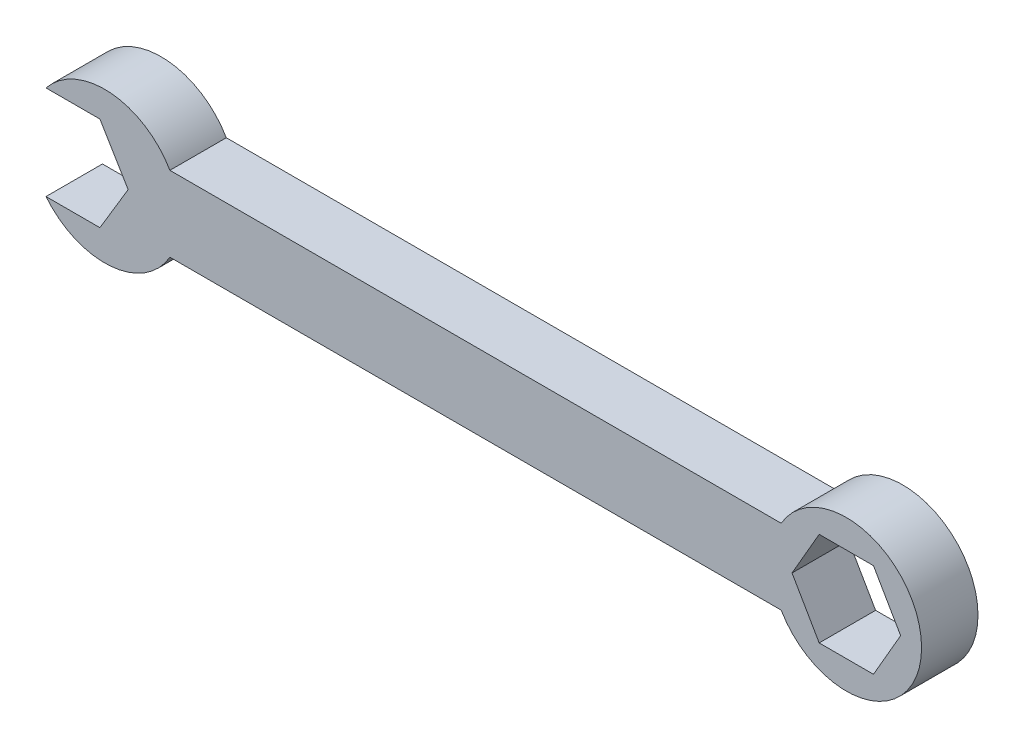
ISO-10303-21;
HEADER;
FILE_DESCRIPTION(('STEP AP214'),'2;1');
FILE_NAME('part.step','',(''),(''),'','','');
FILE_SCHEMA(('AUTOMOTIVE_DESIGN { 1 0 10303 214 1 1 1 1 }'));
ENDSEC;
DATA;
#1=APPLICATION_CONTEXT('core data for automotive mechanical design processes');
#2=APPLICATION_PROTOCOL_DEFINITION('international standard','automotive_design',2000,#1);
#3=PRODUCT_CONTEXT('',#1,'mechanical');
#4=PRODUCT('Part','Part','',(#3));
#5=PRODUCT_RELATED_PRODUCT_CATEGORY('part','',(#4));
#6=PRODUCT_DEFINITION_FORMATION('','',#4);
#7=PRODUCT_DEFINITION_CONTEXT('part definition',#1,'design');
#8=PRODUCT_DEFINITION('design','',#6,#7);
#9=PRODUCT_DEFINITION_SHAPE('','',#8);
#10=(LENGTH_UNIT() NAMED_UNIT(*) SI_UNIT(.MILLI.,.METRE.));
#11=(NAMED_UNIT(*) PLANE_ANGLE_UNIT() SI_UNIT($,.RADIAN.));
#12=(NAMED_UNIT(*) SI_UNIT($,.STERADIAN.) SOLID_ANGLE_UNIT());
#13=UNCERTAINTY_MEASURE_WITH_UNIT(LENGTH_MEASURE(1.E-05),#10,'distance_accuracy_value','');
#14=(GEOMETRIC_REPRESENTATION_CONTEXT(3) GLOBAL_UNCERTAINTY_ASSIGNED_CONTEXT((#13)) GLOBAL_UNIT_ASSIGNED_CONTEXT((#10,
#11,#12)) REPRESENTATION_CONTEXT('',''));
#15=CARTESIAN_POINT('',(0.,0.,0.));
#16=DIRECTION('',(0.,0.,1.));
#17=DIRECTION('',(1.,0.,0.));
#18=AXIS2_PLACEMENT_3D('',#15,#16,#17);
#19=CARTESIAN_POINT('',(0.,5.08,7.62));
#20=DIRECTION('',(0.,1.,0.));
#21=DIRECTION('',(0.,0.,1.));
#22=AXIS2_PLACEMENT_3D('',#19,#20,#21);
#23=PLANE('',#22);
#24=DIRECTION('',(1.,0.,0.));
#25=VECTOR('',#24,1.);
#26=CARTESIAN_POINT('',(0.,5.08,0.));
#27=LINE('',#26,#25);
#28=CARTESIAN_POINT('',(-41.275,5.08,0.));
#29=VERTEX_POINT('',#28);
#30=CARTESIAN_POINT('',(41.275,5.08,0.));
#31=VERTEX_POINT('',#30);
#32=EDGE_CURVE('E257',#29,#31,#27,.T.);
#33=ORIENTED_EDGE('',*,*,#32,.F.);
#34=DIRECTION('',(0.,0.,-1.));
#35=VECTOR('',#34,1.);
#36=CARTESIAN_POINT('',(-41.275,5.08,7.62));
#37=LINE('',#36,#35);
#38=CARTESIAN_POINT('',(-41.275,5.08,7.62));
#39=VERTEX_POINT('',#38);
#40=EDGE_CURVE('E11',#39,#29,#37,.T.);
#41=ORIENTED_EDGE('',*,*,#40,.F.);
#42=DIRECTION('',(1.,0.,0.));
#43=VECTOR('',#42,1.);
#44=CARTESIAN_POINT('',(0.,5.08,7.62));
#45=LINE('',#44,#43);
#46=CARTESIAN_POINT('',(41.275,5.08,7.62));
#47=VERTEX_POINT('',#46);
#48=EDGE_CURVE('E303',#39,#47,#45,.T.);
#49=ORIENTED_EDGE('',*,*,#48,.T.);
#50=DIRECTION('',(0.,0.,-1.));
#51=VECTOR('',#50,1.);
#52=CARTESIAN_POINT('',(41.275,5.08,7.62));
#53=LINE('',#52,#51);
#54=EDGE_CURVE('E118',#47,#31,#53,.T.);
#55=ORIENTED_EDGE('',*,*,#54,.T.);
#56=EDGE_LOOP('',(#33,#41,#49,#55));
#57=FACE_BOUND('',#56,.T.);
#58=ADVANCED_FACE('F43',(#57),#23,.T.);
#59=CARTESIAN_POINT('',(-50.0738181024499,0.,7.62));
#60=DIRECTION('',(0.,0.,-1.));
#61=DIRECTION('',(-1.,0.,0.));
#62=AXIS2_PLACEMENT_3D('',#59,#60,#61);
#63=CYLINDRICAL_SURFACE('',#62,10.16);
#64=CARTESIAN_POINT('',(-50.0738181024499,0.,0.));
#65=DIRECTION('',(0.,0.,1.));
#66=DIRECTION('',(1.,0.,0.));
#67=AXIS2_PLACEMENT_3D('',#64,#65,#66);
#68=CIRCLE('',#67,10.16);
#69=CARTESIAN_POINT('',(-58.0049655604159,6.34999999999999,0.));
#70=VERTEX_POINT('',#69);
#71=EDGE_CURVE('E253',#29,#70,#68,.T.);
#72=ORIENTED_EDGE('',*,*,#71,.T.);
#73=DIRECTION('',(0.,0.,-1.));
#74=VECTOR('',#73,1.);
#75=CARTESIAN_POINT('',(-58.0049655604159,6.34999999999999,7.62));
#76=LINE('',#75,#74);
#77=CARTESIAN_POINT('',(-58.0049655604159,6.34999999999999,7.62));
#78=VERTEX_POINT('',#77);
#79=EDGE_CURVE('E54',#78,#70,#76,.T.);
#80=ORIENTED_EDGE('',*,*,#79,.F.);
#81=CARTESIAN_POINT('',(-50.0738181024499,0.,7.62));
#82=DIRECTION('',(0.,0.,1.));
#83=DIRECTION('',(1.,0.,0.));
#84=AXIS2_PLACEMENT_3D('',#81,#82,#83);
#85=CIRCLE('',#84,10.16);
#86=EDGE_CURVE('E299',#39,#78,#85,.T.);
#87=ORIENTED_EDGE('',*,*,#86,.F.);
#88=ORIENTED_EDGE('',*,*,#40,.T.);
#89=EDGE_LOOP('',(#72,#80,#87,#88));
#90=FACE_BOUND('',#89,.T.);
#91=ADVANCED_FACE('F354',(#90),#63,.T.);
#92=CARTESIAN_POINT('',(0.,6.34999999999998,7.62));
#93=DIRECTION('',(0.,1.,0.));
#94=DIRECTION('',(-1.,0.,0.));
#95=AXIS2_PLACEMENT_3D('',#92,#93,#94);
#96=PLANE('',#95);
#97=DIRECTION('',(1.,0.,0.));
#98=VECTOR('',#97,1.);
#99=CARTESIAN_POINT('',(0.,6.34999999999998,0.));
#100=LINE('',#99,#98);
#101=CARTESIAN_POINT('',(-50.7238827361563,6.34999999999999,0.));
#102=VERTEX_POINT('',#101);
#103=EDGE_CURVE('E249',#70,#102,#100,.T.);
#104=ORIENTED_EDGE('',*,*,#103,.T.);
#105=DIRECTION('',(0.,0.,-1.));
#106=VECTOR('',#105,1.);
#107=CARTESIAN_POINT('',(-50.7238827361563,6.34999999999999,7.62));
#108=LINE('',#107,#106);
#109=CARTESIAN_POINT('',(-50.7238827361563,6.34999999999999,7.62));
#110=VERTEX_POINT('',#109);
#111=EDGE_CURVE('E200',#110,#102,#108,.T.);
#112=ORIENTED_EDGE('',*,*,#111,.F.);
#113=DIRECTION('',(1.,0.,0.));
#114=VECTOR('',#113,1.);
#115=CARTESIAN_POINT('',(0.,6.34999999999998,7.62));
#116=LINE('',#115,#114);
#117=EDGE_CURVE('E295',#78,#110,#116,.T.);
#118=ORIENTED_EDGE('',*,*,#117,.F.);
#119=ORIENTED_EDGE('',*,*,#79,.T.);
#120=EDGE_LOOP('',(#104,#112,#118,#119));
#121=FACE_BOUND('',#120,.T.);
#122=ADVANCED_FACE('F359',(#121),#96,.F.);
#123=CARTESIAN_POINT('',(-34.4955020118796,-20.6973012071278,7.62));
#124=DIRECTION('',(0.857492925712544,0.514495755427527,0.));
#125=DIRECTION('',(-0.514495755427527,0.857492925712544,0.));
#126=AXIS2_PLACEMENT_3D('',#123,#124,#125);
#127=PLANE('',#126);
#128=DIRECTION('',(0.514495755427527,-0.857492925712544,0.));
#129=VECTOR('',#128,1.);
#130=CARTESIAN_POINT('',(-34.4955020118796,-20.6973012071278,0.));
#131=LINE('',#130,#129);
#132=CARTESIAN_POINT('',(-46.9138827361563,0.,0.));
#133=VERTEX_POINT('',#132);
#134=EDGE_CURVE('E245',#102,#133,#131,.T.);
#135=ORIENTED_EDGE('',*,*,#134,.T.);
#136=DIRECTION('',(0.,0.,-1.));
#137=VECTOR('',#136,1.);
#138=CARTESIAN_POINT('',(-46.9138827361563,0.,7.62));
#139=LINE('',#138,#137);
#140=CARTESIAN_POINT('',(-46.9138827361563,0.,7.62));
#141=VERTEX_POINT('',#140);
#142=EDGE_CURVE('E196',#141,#133,#139,.T.);
#143=ORIENTED_EDGE('',*,*,#142,.F.);
#144=DIRECTION('',(0.514495755427527,-0.857492925712544,0.));
#145=VECTOR('',#144,1.);
#146=CARTESIAN_POINT('',(-34.4955020118796,-20.6973012071278,7.62));
#147=LINE('',#146,#145);
#148=EDGE_CURVE('E291',#110,#141,#147,.T.);
#149=ORIENTED_EDGE('',*,*,#148,.F.);
#150=ORIENTED_EDGE('',*,*,#111,.T.);
#151=EDGE_LOOP('',(#135,#143,#149,#150));
#152=FACE_BOUND('',#151,.T.);
#153=ADVANCED_FACE('F365',(#152),#127,.F.);
#154=CARTESIAN_POINT('',(-34.4955020118797,20.6973012071278,7.62));
#155=DIRECTION('',(0.857492925712545,-0.514495755427526,0.));
#156=DIRECTION('',(0.514495755427526,0.857492925712545,0.));
#157=AXIS2_PLACEMENT_3D('',#154,#155,#156);
#158=PLANE('',#157);
#159=DIRECTION('',(-0.514495755427526,-0.857492925712545,0.));
#160=VECTOR('',#159,1.);
#161=CARTESIAN_POINT('',(-34.4955020118797,20.6973012071278,0.));
#162=LINE('',#161,#160);
#163=CARTESIAN_POINT('',(-50.7238827361563,-6.35000000000001,0.));
#164=VERTEX_POINT('',#163);
#165=EDGE_CURVE('E241',#133,#164,#162,.T.);
#166=ORIENTED_EDGE('',*,*,#165,.T.);
#167=DIRECTION('',(0.,0.,-1.));
#168=VECTOR('',#167,1.);
#169=CARTESIAN_POINT('',(-50.7238827361563,-6.35000000000001,7.62));
#170=LINE('',#169,#168);
#171=CARTESIAN_POINT('',(-50.7238827361563,-6.35000000000001,7.62));
#172=VERTEX_POINT('',#171);
#173=EDGE_CURVE('E189',#172,#164,#170,.T.);
#174=ORIENTED_EDGE('',*,*,#173,.F.);
#175=DIRECTION('',(-0.514495755427526,-0.857492925712545,0.));
#176=VECTOR('',#175,1.);
#177=CARTESIAN_POINT('',(-34.4955020118797,20.6973012071278,7.62));
#178=LINE('',#177,#176);
#179=EDGE_CURVE('E288',#141,#172,#178,.T.);
#180=ORIENTED_EDGE('',*,*,#179,.F.);
#181=ORIENTED_EDGE('',*,*,#142,.T.);
#182=EDGE_LOOP('',(#166,#174,#180,#181));
#183=FACE_BOUND('',#182,.T.);
#184=ADVANCED_FACE('F369',(#183),#158,.F.);
#185=CARTESIAN_POINT('',(0.,-6.35000000000003,7.62));
#186=DIRECTION('',(0.,1.,0.));
#187=DIRECTION('',(-1.,0.,0.));
#188=AXIS2_PLACEMENT_3D('',#185,#186,#187);
#189=PLANE('',#188);
#190=DIRECTION('',(1.,0.,0.));
#191=VECTOR('',#190,1.);
#192=CARTESIAN_POINT('',(0.,-6.35000000000003,0.));
#193=LINE('',#192,#191);
#194=CARTESIAN_POINT('',(-58.0049655604159,-6.35000000000001,0.));
#195=VERTEX_POINT('',#194);
#196=EDGE_CURVE('E237',#195,#164,#193,.T.);
#197=ORIENTED_EDGE('',*,*,#196,.F.);
#198=DIRECTION('',(0.,0.,-1.));
#199=VECTOR('',#198,1.);
#200=CARTESIAN_POINT('',(-58.0049655604159,-6.35000000000001,7.62));
#201=LINE('',#200,#199);
#202=CARTESIAN_POINT('',(-58.0049655604159,-6.35000000000001,7.62));
#203=VERTEX_POINT('',#202);
#204=EDGE_CURVE('E185',#203,#195,#201,.T.);
#205=ORIENTED_EDGE('',*,*,#204,.F.);
#206=DIRECTION('',(1.,0.,0.));
#207=VECTOR('',#206,1.);
#208=CARTESIAN_POINT('',(0.,-6.35000000000003,7.62));
#209=LINE('',#208,#207);
#210=EDGE_CURVE('E177',#203,#172,#209,.T.);
#211=ORIENTED_EDGE('',*,*,#210,.T.);
#212=ORIENTED_EDGE('',*,*,#173,.T.);
#213=EDGE_LOOP('',(#197,#205,#211,#212));
#214=FACE_BOUND('',#213,.T.);
#215=ADVANCED_FACE('F373',(#214),#189,.T.);
#216=CARTESIAN_POINT('',(-50.0738181024499,0.,7.62));
#217=DIRECTION('',(0.,0.,-1.));
#218=DIRECTION('',(-1.,0.,0.));
#219=AXIS2_PLACEMENT_3D('',#216,#217,#218);
#220=CYLINDRICAL_SURFACE('',#219,10.16);
#221=CARTESIAN_POINT('',(-50.0738181024499,0.,0.));
#222=DIRECTION('',(0.,0.,1.));
#223=DIRECTION('',(1.,0.,0.));
#224=AXIS2_PLACEMENT_3D('',#221,#222,#223);
#225=CIRCLE('',#224,10.16);
#226=CARTESIAN_POINT('',(-41.275,-5.08,0.));
#227=VERTEX_POINT('',#226);
#228=EDGE_CURVE('E183',#195,#227,#225,.T.);
#229=ORIENTED_EDGE('',*,*,#228,.T.);
#230=DIRECTION('',(0.,0.,-1.));
#231=VECTOR('',#230,1.);
#232=CARTESIAN_POINT('',(-41.275,-5.08,7.62));
#233=LINE('',#232,#231);
#234=CARTESIAN_POINT('',(-41.275,-5.08,7.62));
#235=VERTEX_POINT('',#234);
#236=EDGE_CURVE('E167',#235,#227,#233,.T.);
#237=ORIENTED_EDGE('',*,*,#236,.F.);
#238=CARTESIAN_POINT('',(-50.0738181024499,0.,7.62));
#239=DIRECTION('',(0.,0.,1.));
#240=DIRECTION('',(1.,0.,0.));
#241=AXIS2_PLACEMENT_3D('',#238,#239,#240);
#242=CIRCLE('',#241,10.16);
#243=EDGE_CURVE('E171',#203,#235,#242,.T.);
#244=ORIENTED_EDGE('',*,*,#243,.F.);
#245=ORIENTED_EDGE('',*,*,#204,.T.);
#246=EDGE_LOOP('',(#229,#237,#244,#245));
#247=FACE_BOUND('',#246,.T.);
#248=ADVANCED_FACE('F181',(#247),#220,.T.);
#249=CARTESIAN_POINT('',(0.,-5.08,7.62));
#250=DIRECTION('',(0.,1.,0.));
#251=DIRECTION('',(0.,0.,1.));
#252=AXIS2_PLACEMENT_3D('',#249,#250,#251);
#253=PLANE('',#252);
#254=DIRECTION('',(1.,0.,0.));
#255=VECTOR('',#254,1.);
#256=CARTESIAN_POINT('',(0.,-5.08,0.));
#257=LINE('',#256,#255);
#258=CARTESIAN_POINT('',(41.275,-5.08,0.));
#259=VERTEX_POINT('',#258);
#260=EDGE_CURVE('E232',#227,#259,#257,.T.);
#261=ORIENTED_EDGE('',*,*,#260,.T.);
#262=DIRECTION('',(0.,0.,-1.));
#263=VECTOR('',#262,1.);
#264=CARTESIAN_POINT('',(41.275,-5.08,7.62));
#265=LINE('',#264,#263);
#266=CARTESIAN_POINT('',(41.275,-5.08,7.62));
#267=VERTEX_POINT('',#266);
#268=EDGE_CURVE('E169',#267,#259,#265,.T.);
#269=ORIENTED_EDGE('',*,*,#268,.F.);
#270=DIRECTION('',(1.,0.,0.));
#271=VECTOR('',#270,1.);
#272=CARTESIAN_POINT('',(0.,-5.08,7.62));
#273=LINE('',#272,#271);
#274=EDGE_CURVE('E162',#235,#267,#273,.T.);
#275=ORIENTED_EDGE('',*,*,#274,.F.);
#276=ORIENTED_EDGE('',*,*,#236,.T.);
#277=EDGE_LOOP('',(#261,#269,#275,#276));
#278=FACE_BOUND('',#277,.T.);
#279=ADVANCED_FACE('F165',(#278),#253,.F.);
#280=CARTESIAN_POINT('',(43.0546248908686,-24.8575992706013,7.62));
#281=DIRECTION('',(-0.866025403784439,0.5,0.));
#282=DIRECTION('',(-0.5,-0.866025403784439,0.));
#283=AXIS2_PLACEMENT_3D('',#280,#281,#282);
#284=PLANE('',#283);
#285=DIRECTION('',(0.5,0.866025403784439,0.));
#286=VECTOR('',#285,1.);
#287=CARTESIAN_POINT('',(43.0546248908686,-24.8575992706013,0.));
#288=LINE('',#287,#286);
#289=CARTESIAN_POINT('',(53.739992311804,-6.35,0.));
#290=VERTEX_POINT('',#289);
#291=CARTESIAN_POINT('',(57.4061665211581,0.,0.));
#292=VERTEX_POINT('',#291);
#293=EDGE_CURVE('E280',#290,#292,#288,.T.);
#294=ORIENTED_EDGE('',*,*,#293,.F.);
#295=DIRECTION('',(0.,0.,-1.));
#296=VECTOR('',#295,1.);
#297=CARTESIAN_POINT('',(53.739992311804,-6.35,7.62));
#298=LINE('',#297,#296);
#299=CARTESIAN_POINT('',(53.739992311804,-6.35,7.62));
#300=VERTEX_POINT('',#299);
#301=EDGE_CURVE('E47',#300,#290,#298,.T.);
#302=ORIENTED_EDGE('',*,*,#301,.F.);
#303=DIRECTION('',(0.5,0.866025403784439,0.));
#304=VECTOR('',#303,1.);
#305=CARTESIAN_POINT('',(43.0546248908686,-24.8575992706013,7.62));
#306=LINE('',#305,#304);
#307=CARTESIAN_POINT('',(57.4061665211581,0.,7.62));
#308=VERTEX_POINT('',#307);
#309=EDGE_CURVE('E231',#300,#308,#306,.T.);
#310=ORIENTED_EDGE('',*,*,#309,.T.);
#311=DIRECTION('',(0.,0.,-1.));
#312=VECTOR('',#311,1.);
#313=CARTESIAN_POINT('',(57.4061665211581,0.,7.62));
#314=LINE('',#313,#312);
#315=EDGE_CURVE('E207',#308,#292,#314,.T.);
#316=ORIENTED_EDGE('',*,*,#315,.T.);
#317=EDGE_LOOP('',(#294,#302,#310,#316));
#318=FACE_BOUND('',#317,.T.);
#319=ADVANCED_FACE('F45',(#318),#284,.T.);
#320=CARTESIAN_POINT('',(0.,-6.34999999999998,7.62));
#321=DIRECTION('',(0.,1.,0.));
#322=DIRECTION('',(-1.,0.,0.));
#323=AXIS2_PLACEMENT_3D('',#320,#321,#322);
#324=PLANE('',#323);
#325=DIRECTION('',(1.,0.,0.));
#326=VECTOR('',#325,1.);
#327=CARTESIAN_POINT('',(0.,-6.34999999999998,0.));
#328=LINE('',#327,#326);
#329=CARTESIAN_POINT('',(46.4076438930958,-6.34999999999999,0.));
#330=VERTEX_POINT('',#329);
#331=EDGE_CURVE('E276',#330,#290,#328,.T.);
#332=ORIENTED_EDGE('',*,*,#331,.F.);
#333=DIRECTION('',(0.,0.,-1.));
#334=VECTOR('',#333,1.);
#335=CARTESIAN_POINT('',(46.4076438930958,-6.34999999999999,7.62));
#336=LINE('',#335,#334);
#337=CARTESIAN_POINT('',(46.4076438930958,-6.34999999999999,7.62));
#338=VERTEX_POINT('',#337);
#339=EDGE_CURVE('E218',#338,#330,#336,.T.);
#340=ORIENTED_EDGE('',*,*,#339,.F.);
#341=DIRECTION('',(1.,0.,0.));
#342=VECTOR('',#341,1.);
#343=CARTESIAN_POINT('',(0.,-6.34999999999998,7.62));
#344=LINE('',#343,#342);
#345=EDGE_CURVE('E321',#338,#300,#344,.T.);
#346=ORIENTED_EDGE('',*,*,#345,.T.);
#347=ORIENTED_EDGE('',*,*,#301,.T.);
#348=EDGE_LOOP('',(#332,#340,#346,#347));
#349=FACE_BOUND('',#348,.T.);
#350=ADVANCED_FACE('F336',(#349),#324,.T.);
#351=CARTESIAN_POINT('',(32.0561022628062,18.5075992706014,7.62));
#352=DIRECTION('',(0.866025403784439,0.5,0.));
#353=DIRECTION('',(-0.5,0.866025403784439,0.));
#354=AXIS2_PLACEMENT_3D('',#351,#352,#353);
#355=PLANE('',#354);
#356=DIRECTION('',(0.5,-0.866025403784439,0.));
#357=VECTOR('',#356,1.);
#358=CARTESIAN_POINT('',(32.0561022628062,18.5075992706014,0.));
#359=LINE('',#358,#357);
#360=CARTESIAN_POINT('',(42.7414696837416,0.,0.));
#361=VERTEX_POINT('',#360);
#362=EDGE_CURVE('E272',#361,#330,#359,.T.);
#363=ORIENTED_EDGE('',*,*,#362,.F.);
#364=DIRECTION('',(0.,0.,-1.));
#365=VECTOR('',#364,1.);
#366=CARTESIAN_POINT('',(42.7414696837416,0.,7.62));
#367=LINE('',#366,#365);
#368=CARTESIAN_POINT('',(42.7414696837416,0.,7.62));
#369=VERTEX_POINT('',#368);
#370=EDGE_CURVE('E216',#369,#361,#367,.T.);
#371=ORIENTED_EDGE('',*,*,#370,.F.);
#372=DIRECTION('',(0.5,-0.866025403784439,0.));
#373=VECTOR('',#372,1.);
#374=CARTESIAN_POINT('',(32.0561022628062,18.5075992706014,7.62));
#375=LINE('',#374,#373);
#376=EDGE_CURVE('E318',#369,#338,#375,.T.);
#377=ORIENTED_EDGE('',*,*,#376,.T.);
#378=ORIENTED_EDGE('',*,*,#339,.T.);
#379=EDGE_LOOP('',(#363,#371,#377,#378));
#380=FACE_BOUND('',#379,.T.);
#381=ADVANCED_FACE('F338',(#380),#355,.T.);
#382=CARTESIAN_POINT('',(32.0561022628062,-18.5075992706014,7.62));
#383=DIRECTION('',(0.866025403784439,-0.5,0.));
#384=DIRECTION('',(0.5,0.866025403784439,0.));
#385=AXIS2_PLACEMENT_3D('',#382,#383,#384);
#386=PLANE('',#385);
#387=DIRECTION('',(-0.5,-0.866025403784439,0.));
#388=VECTOR('',#387,1.);
#389=CARTESIAN_POINT('',(32.0561022628062,-18.5075992706014,0.));
#390=LINE('',#389,#388);
#391=CARTESIAN_POINT('',(46.4076438930958,6.35,0.));
#392=VERTEX_POINT('',#391);
#393=EDGE_CURVE('E268',#392,#361,#390,.T.);
#394=ORIENTED_EDGE('',*,*,#393,.F.);
#395=DIRECTION('',(0.,0.,-1.));
#396=VECTOR('',#395,1.);
#397=CARTESIAN_POINT('',(46.4076438930958,6.35,7.62));
#398=LINE('',#397,#396);
#399=CARTESIAN_POINT('',(46.4076438930958,6.35,7.62));
#400=VERTEX_POINT('',#399);
#401=EDGE_CURVE('E213',#400,#392,#398,.T.);
#402=ORIENTED_EDGE('',*,*,#401,.F.);
#403=DIRECTION('',(-0.5,-0.866025403784439,0.));
#404=VECTOR('',#403,1.);
#405=CARTESIAN_POINT('',(32.0561022628062,-18.5075992706014,7.62));
#406=LINE('',#405,#404);
#407=EDGE_CURVE('E314',#400,#369,#406,.T.);
#408=ORIENTED_EDGE('',*,*,#407,.T.);
#409=ORIENTED_EDGE('',*,*,#370,.T.);
#410=EDGE_LOOP('',(#394,#402,#408,#409));
#411=FACE_BOUND('',#410,.T.);
#412=ADVANCED_FACE('F341',(#411),#386,.T.);
#413=CARTESIAN_POINT('',(0.,6.35000000000001,7.62));
#414=DIRECTION('',(0.,-1.,0.));
#415=DIRECTION('',(1.,0.,0.));
#416=AXIS2_PLACEMENT_3D('',#413,#414,#415);
#417=PLANE('',#416);
#418=DIRECTION('',(-1.,0.,0.));
#419=VECTOR('',#418,1.);
#420=CARTESIAN_POINT('',(0.,6.35000000000001,0.));
#421=LINE('',#420,#419);
#422=CARTESIAN_POINT('',(53.739992311804,6.35,0.));
#423=VERTEX_POINT('',#422);
#424=EDGE_CURVE('E264',#423,#392,#421,.T.);
#425=ORIENTED_EDGE('',*,*,#424,.F.);
#426=DIRECTION('',(0.,0.,-1.));
#427=VECTOR('',#426,1.);
#428=CARTESIAN_POINT('',(53.739992311804,6.35,7.62));
#429=LINE('',#428,#427);
#430=CARTESIAN_POINT('',(53.739992311804,6.35,7.62));
#431=VERTEX_POINT('',#430);
#432=EDGE_CURVE('E210',#431,#423,#429,.T.);
#433=ORIENTED_EDGE('',*,*,#432,.F.);
#434=DIRECTION('',(-1.,0.,0.));
#435=VECTOR('',#434,1.);
#436=CARTESIAN_POINT('',(0.,6.35000000000001,7.62));
#437=LINE('',#436,#435);
#438=EDGE_CURVE('E310',#431,#400,#437,.T.);
#439=ORIENTED_EDGE('',*,*,#438,.T.);
#440=ORIENTED_EDGE('',*,*,#401,.T.);
#441=EDGE_LOOP('',(#425,#433,#439,#440));
#442=FACE_BOUND('',#441,.T.);
#443=ADVANCED_FACE('F343',(#442),#417,.T.);
#444=CARTESIAN_POINT('',(43.0546248908686,24.8575992706014,7.62));
#445=DIRECTION('',(-0.866025403784438,-0.5,0.));
#446=DIRECTION('',(0.500000000000001,-0.866025403784438,0.));
#447=AXIS2_PLACEMENT_3D('',#444,#445,#446);
#448=PLANE('',#447);
#449=DIRECTION('',(-0.5,0.866025403784438,0.));
#450=VECTOR('',#449,1.);
#451=CARTESIAN_POINT('',(43.0546248908686,24.8575992706014,0.));
#452=LINE('',#451,#450);
#453=EDGE_CURVE('E260',#292,#423,#452,.T.);
#454=ORIENTED_EDGE('',*,*,#453,.F.);
#455=ORIENTED_EDGE('',*,*,#315,.F.);
#456=DIRECTION('',(-0.5,0.866025403784438,0.));
#457=VECTOR('',#456,1.);
#458=CARTESIAN_POINT('',(43.0546248908686,24.8575992706014,7.62));
#459=LINE('',#458,#457);
#460=EDGE_CURVE('E306',#308,#431,#459,.T.);
#461=ORIENTED_EDGE('',*,*,#460,.T.);
#462=ORIENTED_EDGE('',*,*,#432,.T.);
#463=EDGE_LOOP('',(#454,#455,#461,#462));
#464=FACE_BOUND('',#463,.T.);
#465=ADVANCED_FACE('F332',(#464),#448,.T.);
#466=CARTESIAN_POINT('',(50.0738181024499,0.,7.62));
#467=DIRECTION('',(0.,0.,-1.));
#468=DIRECTION('',(-1.,0.,0.));
#469=AXIS2_PLACEMENT_3D('',#466,#467,#468);
#470=CYLINDRICAL_SURFACE('',#469,10.16);
#471=CARTESIAN_POINT('',(50.0738181024499,0.,0.));
#472=DIRECTION('',(0.,0.,1.));
#473=DIRECTION('',(1.,0.,0.));
#474=AXIS2_PLACEMENT_3D('',#471,#472,#473);
#475=CIRCLE('',#474,10.16);
#476=EDGE_CURVE('E111',#259,#31,#475,.T.);
#477=ORIENTED_EDGE('',*,*,#476,.T.);
#478=ORIENTED_EDGE('',*,*,#54,.F.);
#479=CARTESIAN_POINT('',(50.0738181024499,0.,7.62));
#480=DIRECTION('',(0.,0.,1.));
#481=DIRECTION('',(1.,0.,0.));
#482=AXIS2_PLACEMENT_3D('',#479,#480,#481);
#483=CIRCLE('',#482,10.16);
#484=EDGE_CURVE('E63',#267,#47,#483,.T.);
#485=ORIENTED_EDGE('',*,*,#484,.F.);
#486=ORIENTED_EDGE('',*,*,#268,.T.);
#487=EDGE_LOOP('',(#477,#478,#485,#486));
#488=FACE_BOUND('',#487,.T.);
#489=ADVANCED_FACE('F350',(#488),#470,.T.);
#490=CARTESIAN_POINT('',(0.,0.,7.62));
#491=DIRECTION('',(0.,0.,1.));
#492=DIRECTION('',(1.,0.,0.));
#493=AXIS2_PLACEMENT_3D('',#490,#491,#492);
#494=PLANE('',#493);
#495=ORIENTED_EDGE('',*,*,#309,.F.);
#496=ORIENTED_EDGE('',*,*,#345,.F.);
#497=ORIENTED_EDGE('',*,*,#376,.F.);
#498=ORIENTED_EDGE('',*,*,#407,.F.);
#499=ORIENTED_EDGE('',*,*,#438,.F.);
#500=ORIENTED_EDGE('',*,*,#460,.F.);
#501=EDGE_LOOP('',(#495,#496,#497,#498,#499,#500));
#502=FACE_BOUND('',#501,.T.);
#503=ORIENTED_EDGE('',*,*,#48,.F.);
#504=ORIENTED_EDGE('',*,*,#86,.T.);
#505=ORIENTED_EDGE('',*,*,#117,.T.);
#506=ORIENTED_EDGE('',*,*,#148,.T.);
#507=ORIENTED_EDGE('',*,*,#179,.T.);
#508=ORIENTED_EDGE('',*,*,#210,.F.);
#509=ORIENTED_EDGE('',*,*,#243,.T.);
#510=ORIENTED_EDGE('',*,*,#274,.T.);
#511=ORIENTED_EDGE('',*,*,#484,.T.);
#512=EDGE_LOOP('',(#503,#504,#505,#506,#507,#508,#509,#510,#511));
#513=FACE_BOUND('',#512,.T.);
#514=ADVANCED_FACE('F175',(#502,#513),#494,.T.);
#515=CARTESIAN_POINT('',(0.,0.,0.));
#516=DIRECTION('',(0.,0.,1.));
#517=DIRECTION('',(1.,0.,0.));
#518=AXIS2_PLACEMENT_3D('',#515,#516,#517);
#519=PLANE('',#518);
#520=ORIENTED_EDGE('',*,*,#293,.T.);
#521=ORIENTED_EDGE('',*,*,#453,.T.);
#522=ORIENTED_EDGE('',*,*,#424,.T.);
#523=ORIENTED_EDGE('',*,*,#393,.T.);
#524=ORIENTED_EDGE('',*,*,#362,.T.);
#525=ORIENTED_EDGE('',*,*,#331,.T.);
#526=EDGE_LOOP('',(#520,#521,#522,#523,#524,#525));
#527=FACE_BOUND('',#526,.T.);
#528=ORIENTED_EDGE('',*,*,#32,.T.);
#529=ORIENTED_EDGE('',*,*,#476,.F.);
#530=ORIENTED_EDGE('',*,*,#260,.F.);
#531=ORIENTED_EDGE('',*,*,#228,.F.);
#532=ORIENTED_EDGE('',*,*,#196,.T.);
#533=ORIENTED_EDGE('',*,*,#165,.F.);
#534=ORIENTED_EDGE('',*,*,#134,.F.);
#535=ORIENTED_EDGE('',*,*,#103,.F.);
#536=ORIENTED_EDGE('',*,*,#71,.F.);
#537=EDGE_LOOP('',(#528,#529,#530,#531,#532,#533,#534,#535,#536));
#538=FACE_BOUND('',#537,.T.);
#539=ADVANCED_FACE('F335',(#527,#538),#519,.F.);
#540=CLOSED_SHELL('',(#58,#91,#122,#153,#184,#215,#248,#279,#319,#350,#381,#412,#443,#465,#489,
#514,#539));
#541=MANIFOLD_SOLID_BREP('B2',#540);
#542=ADVANCED_BREP_SHAPE_REPRESENTATION('',(#18,#541),#14);
#543=SHAPE_DEFINITION_REPRESENTATION(#9,#542);
ENDSEC;
END-ISO-10303-21;
